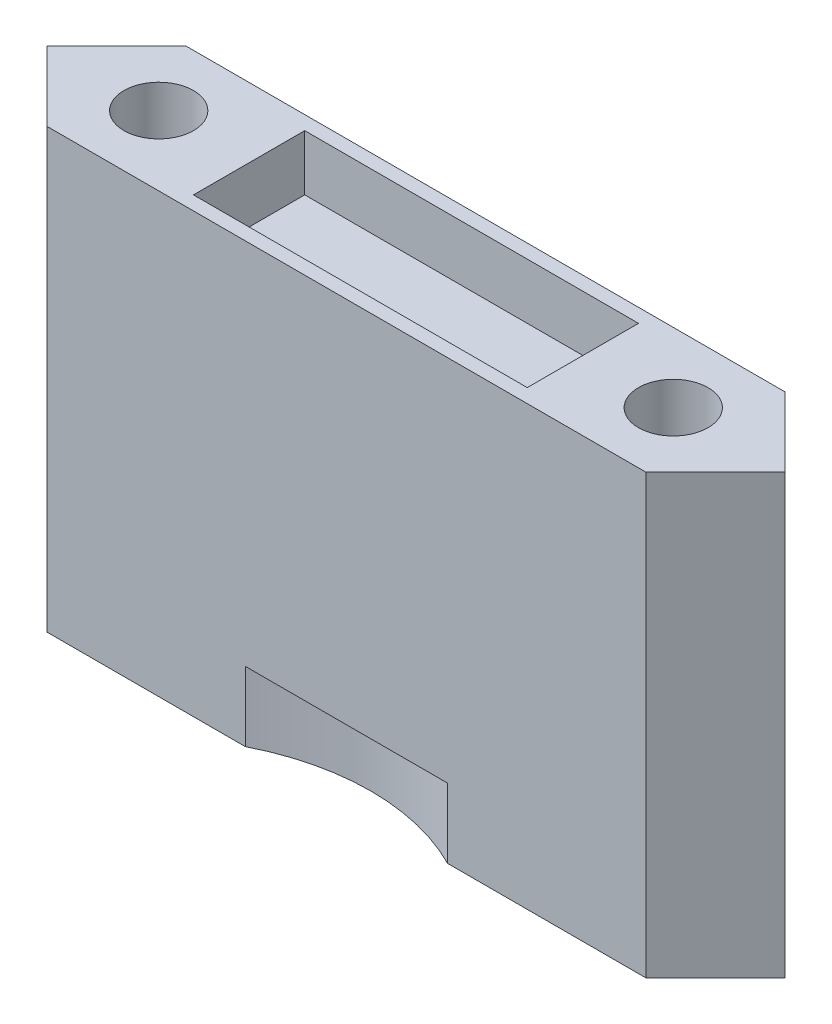
ISO-10303-21;
HEADER;
FILE_DESCRIPTION(('STEP AP214'),'2;1');
FILE_NAME('part.step','',(''),(''),'','','');
FILE_SCHEMA(('AUTOMOTIVE_DESIGN { 1 0 10303 214 1 1 1 1 }'));
ENDSEC;
DATA;
#1=APPLICATION_CONTEXT('core data for automotive mechanical design processes');
#2=APPLICATION_PROTOCOL_DEFINITION('international standard','automotive_design',2000,#1);
#3=PRODUCT_CONTEXT('',#1,'mechanical');
#4=PRODUCT('Part','Part','',(#3));
#5=PRODUCT_RELATED_PRODUCT_CATEGORY('part','',(#4));
#6=PRODUCT_DEFINITION_FORMATION('','',#4);
#7=PRODUCT_DEFINITION_CONTEXT('part definition',#1,'design');
#8=PRODUCT_DEFINITION('design','',#6,#7);
#9=PRODUCT_DEFINITION_SHAPE('','',#8);
#10=(LENGTH_UNIT() NAMED_UNIT(*) SI_UNIT(.MILLI.,.METRE.));
#11=(NAMED_UNIT(*) PLANE_ANGLE_UNIT() SI_UNIT($,.RADIAN.));
#12=(NAMED_UNIT(*) SI_UNIT($,.STERADIAN.) SOLID_ANGLE_UNIT());
#13=UNCERTAINTY_MEASURE_WITH_UNIT(LENGTH_MEASURE(1.E-05),#10,'distance_accuracy_value','');
#14=(GEOMETRIC_REPRESENTATION_CONTEXT(3) GLOBAL_UNCERTAINTY_ASSIGNED_CONTEXT((#13)) GLOBAL_UNIT_ASSIGNED_CONTEXT((#10,
#11,#12)) REPRESENTATION_CONTEXT('',''));
#15=CARTESIAN_POINT('',(0.,0.,0.));
#16=DIRECTION('',(0.,0.,1.));
#17=DIRECTION('',(1.,0.,0.));
#18=AXIS2_PLACEMENT_3D('',#15,#16,#17);
#19=CARTESIAN_POINT('',(0.,40.,0.));
#20=DIRECTION('',(0.,1.,0.));
#21=DIRECTION('',(0.,0.,1.));
#22=AXIS2_PLACEMENT_3D('',#19,#20,#21);
#23=PLANE('',#22);
#24=DIRECTION('',(0.,0.,1.));
#25=VECTOR('',#24,1.);
#26=CARTESIAN_POINT('',(-15.24,40.,5.08));
#27=LINE('',#26,#25);
#28=CARTESIAN_POINT('',(-15.24,40.,-5.08));
#29=VERTEX_POINT('',#28);
#30=CARTESIAN_POINT('',(-15.24,40.,5.08));
#31=VERTEX_POINT('',#30);
#32=EDGE_CURVE('E55',#29,#31,#27,.T.);
#33=ORIENTED_EDGE('',*,*,#32,.F.);
#34=DIRECTION('',(-1.,0.,0.));
#35=VECTOR('',#34,1.);
#36=CARTESIAN_POINT('',(15.24,40.,-5.08));
#37=LINE('',#36,#35);
#38=CARTESIAN_POINT('',(15.24,40.,-5.08));
#39=VERTEX_POINT('',#38);
#40=EDGE_CURVE('E217',#39,#29,#37,.T.);
#41=ORIENTED_EDGE('',*,*,#40,.F.);
#42=DIRECTION('',(0.,0.,-1.));
#43=VECTOR('',#42,1.);
#44=CARTESIAN_POINT('',(15.24,40.,5.08));
#45=LINE('',#44,#43);
#46=CARTESIAN_POINT('',(15.24,40.,5.08));
#47=VERTEX_POINT('',#46);
#48=EDGE_CURVE('E221',#47,#39,#45,.T.);
#49=ORIENTED_EDGE('',*,*,#48,.F.);
#50=DIRECTION('',(1.,0.,0.));
#51=VECTOR('',#50,1.);
#52=CARTESIAN_POINT('',(15.24,40.,5.08));
#53=LINE('',#52,#51);
#54=EDGE_CURVE('E224',#31,#47,#53,.T.);
#55=ORIENTED_EDGE('',*,*,#54,.F.);
#56=EDGE_LOOP('',(#33,#41,#49,#55));
#57=FACE_BOUND('',#56,.T.);
#58=CARTESIAN_POINT('',(-23.495,40.,0.));
#59=DIRECTION('',(0.,1.,0.));
#60=DIRECTION('',(0.,0.,1.));
#61=AXIS2_PLACEMENT_3D('',#58,#59,#60);
#62=CIRCLE('',#61,3.175);
#63=CARTESIAN_POINT('',(-23.495,40.,3.175));
#64=VERTEX_POINT('',#63);
#65=EDGE_CURVE('E186',#64,#64,#62,.T.);
#66=ORIENTED_EDGE('',*,*,#65,.F.);
#67=EDGE_LOOP('',(#66));
#68=FACE_BOUND('',#67,.T.);
#69=DIRECTION('',(-1.,0.,0.));
#70=VECTOR('',#69,1.);
#71=CARTESIAN_POINT('',(27.3588491430402,40.,-6.35));
#72=LINE('',#71,#70);
#73=CARTESIAN_POINT('',(27.3588491430402,40.,-6.35));
#74=VERTEX_POINT('',#73);
#75=CARTESIAN_POINT('',(-27.3588491430402,40.,-6.35));
#76=VERTEX_POINT('',#75);
#77=EDGE_CURVE('E151',#74,#76,#72,.T.);
#78=ORIENTED_EDGE('',*,*,#77,.T.);
#79=DIRECTION('',(-0.707106781186551,0.,0.707106781186544));
#80=VECTOR('',#79,1.);
#81=CARTESIAN_POINT('',(-27.3588491430402,40.,-6.35));
#82=LINE('',#81,#80);
#83=CARTESIAN_POINT('',(-33.7088491430403,40.,0.));
#84=VERTEX_POINT('',#83);
#85=EDGE_CURVE('E181',#76,#84,#82,.T.);
#86=ORIENTED_EDGE('',*,*,#85,.T.);
#87=DIRECTION('',(0.707106781186551,0.,0.707106781186544));
#88=VECTOR('',#87,1.);
#89=CARTESIAN_POINT('',(-33.7088491430403,40.,0.));
#90=LINE('',#89,#88);
#91=CARTESIAN_POINT('',(-27.3588491430402,40.,6.35));
#92=VERTEX_POINT('',#91);
#93=EDGE_CURVE('E178',#84,#92,#90,.T.);
#94=ORIENTED_EDGE('',*,*,#93,.T.);
#95=DIRECTION('',(1.,0.,0.));
#96=VECTOR('',#95,1.);
#97=CARTESIAN_POINT('',(27.3588491430402,40.,6.35));
#98=LINE('',#97,#96);
#99=CARTESIAN_POINT('',(27.3588491430402,40.,6.35));
#100=VERTEX_POINT('',#99);
#101=EDGE_CURVE('E192',#92,#100,#98,.T.);
#102=ORIENTED_EDGE('',*,*,#101,.T.);
#103=DIRECTION('',(0.707106781186551,0.,-0.707106781186544));
#104=VECTOR('',#103,1.);
#105=CARTESIAN_POINT('',(33.7088491430403,40.,0.));
#106=LINE('',#105,#104);
#107=CARTESIAN_POINT('',(33.7088491430403,40.,0.));
#108=VERTEX_POINT('',#107);
#109=EDGE_CURVE('E190',#100,#108,#106,.T.);
#110=ORIENTED_EDGE('',*,*,#109,.T.);
#111=DIRECTION('',(-0.707106781186551,0.,-0.707106781186544));
#112=VECTOR('',#111,1.);
#113=CARTESIAN_POINT('',(27.3588491430402,40.,-6.35));
#114=LINE('',#113,#112);
#115=EDGE_CURVE('E156',#108,#74,#114,.T.);
#116=ORIENTED_EDGE('',*,*,#115,.T.);
#117=EDGE_LOOP('',(#78,#86,#94,#102,#110,#116));
#118=FACE_BOUND('',#117,.T.);
#119=CARTESIAN_POINT('',(23.495,40.,0.));
#120=DIRECTION('',(0.,1.,0.));
#121=DIRECTION('',(0.,0.,1.));
#122=AXIS2_PLACEMENT_3D('',#119,#120,#121);
#123=CIRCLE('',#122,3.175);
#124=CARTESIAN_POINT('',(23.495,40.,3.175));
#125=VERTEX_POINT('',#124);
#126=EDGE_CURVE('E200',#125,#125,#123,.T.);
#127=ORIENTED_EDGE('',*,*,#126,.F.);
#128=EDGE_LOOP('',(#127));
#129=FACE_BOUND('',#128,.T.);
#130=ADVANCED_FACE('F33',(#57,#68,#118,#129),#23,.T.);
#131=CARTESIAN_POINT('',(0.,0.,0.));
#132=DIRECTION('',(0.,1.,0.));
#133=DIRECTION('',(0.,0.,1.));
#134=AXIS2_PLACEMENT_3D('',#131,#132,#133);
#135=PLANE('',#134);
#136=DIRECTION('',(1.,0.,0.));
#137=VECTOR('',#136,1.);
#138=CARTESIAN_POINT('',(27.3588491430402,0.,6.35));
#139=LINE('',#138,#137);
#140=CARTESIAN_POINT('',(9.23527800177862,0.,6.35));
#141=VERTEX_POINT('',#140);
#142=CARTESIAN_POINT('',(27.3588491430402,0.,6.35));
#143=VERTEX_POINT('',#142);
#144=EDGE_CURVE('E133',#141,#143,#139,.T.);
#145=ORIENTED_EDGE('',*,*,#144,.F.);
#146=CARTESIAN_POINT('',(0.,0.,24.4500563598532));
#147=DIRECTION('',(0.,-1.,0.));
#148=DIRECTION('',(0.,0.,-1.));
#149=AXIS2_PLACEMENT_3D('',#146,#147,#148);
#150=CIRCLE('',#149,20.32);
#151=CARTESIAN_POINT('',(-9.23527800177862,0.,6.35));
#152=VERTEX_POINT('',#151);
#153=EDGE_CURVE('E121',#152,#141,#150,.T.);
#154=ORIENTED_EDGE('',*,*,#153,.F.);
#155=CARTESIAN_POINT('',(-27.3588491430402,0.,6.35));
#156=VERTEX_POINT('',#155);
#157=EDGE_CURVE('E141',#156,#152,#139,.T.);
#158=ORIENTED_EDGE('',*,*,#157,.F.);
#159=DIRECTION('',(0.707106781186551,0.,0.707106781186544));
#160=VECTOR('',#159,1.);
#161=CARTESIAN_POINT('',(-33.7088491430403,0.,0.));
#162=LINE('',#161,#160);
#163=CARTESIAN_POINT('',(-33.7088491430403,0.,0.));
#164=VERTEX_POINT('',#163);
#165=EDGE_CURVE('E142',#164,#156,#162,.T.);
#166=ORIENTED_EDGE('',*,*,#165,.F.);
#167=DIRECTION('',(-0.707106781186551,0.,0.707106781186544));
#168=VECTOR('',#167,1.);
#169=CARTESIAN_POINT('',(-27.3588491430402,0.,-6.35));
#170=LINE('',#169,#168);
#171=CARTESIAN_POINT('',(-27.3588491430402,0.,-6.35));
#172=VERTEX_POINT('',#171);
#173=EDGE_CURVE('E144',#172,#164,#170,.T.);
#174=ORIENTED_EDGE('',*,*,#173,.F.);
#175=DIRECTION('',(-1.,0.,0.));
#176=VECTOR('',#175,1.);
#177=CARTESIAN_POINT('',(27.3588491430402,0.,-6.35));
#178=LINE('',#177,#176);
#179=CARTESIAN_POINT('',(27.3588491430402,0.,-6.35));
#180=VERTEX_POINT('',#179);
#181=EDGE_CURVE('E185',#180,#172,#178,.T.);
#182=ORIENTED_EDGE('',*,*,#181,.F.);
#183=DIRECTION('',(-0.707106781186551,0.,-0.707106781186544));
#184=VECTOR('',#183,1.);
#185=CARTESIAN_POINT('',(27.3588491430402,0.,-6.35));
#186=LINE('',#185,#184);
#187=CARTESIAN_POINT('',(33.7088491430403,0.,0.));
#188=VERTEX_POINT('',#187);
#189=EDGE_CURVE('E149',#188,#180,#186,.T.);
#190=ORIENTED_EDGE('',*,*,#189,.F.);
#191=DIRECTION('',(0.707106781186551,0.,-0.707106781186544));
#192=VECTOR('',#191,1.);
#193=CARTESIAN_POINT('',(33.7088491430403,0.,0.));
#194=LINE('',#193,#192);
#195=EDGE_CURVE('E140',#143,#188,#194,.T.);
#196=ORIENTED_EDGE('',*,*,#195,.F.);
#197=EDGE_LOOP('',(#145,#154,#158,#166,#174,#182,#190,#196));
#198=FACE_BOUND('',#197,.T.);
#199=CARTESIAN_POINT('',(-23.495,0.,0.));
#200=DIRECTION('',(0.,1.,0.));
#201=DIRECTION('',(0.,0.,1.));
#202=AXIS2_PLACEMENT_3D('',#199,#200,#201);
#203=CIRCLE('',#202,3.175);
#204=CARTESIAN_POINT('',(-23.495,0.,3.175));
#205=VERTEX_POINT('',#204);
#206=EDGE_CURVE('E197',#205,#205,#203,.T.);
#207=ORIENTED_EDGE('',*,*,#206,.T.);
#208=EDGE_LOOP('',(#207));
#209=FACE_BOUND('',#208,.T.);
#210=CARTESIAN_POINT('',(23.495,0.,0.));
#211=DIRECTION('',(0.,1.,0.));
#212=DIRECTION('',(0.,0.,1.));
#213=AXIS2_PLACEMENT_3D('',#210,#211,#212);
#214=CIRCLE('',#213,3.175);
#215=CARTESIAN_POINT('',(23.495,0.,3.175));
#216=VERTEX_POINT('',#215);
#217=EDGE_CURVE('E203',#216,#216,#214,.T.);
#218=ORIENTED_EDGE('',*,*,#217,.T.);
#219=EDGE_LOOP('',(#218));
#220=FACE_BOUND('',#219,.T.);
#221=ADVANCED_FACE('F137',(#198,#209,#220),#135,.F.);
#222=CARTESIAN_POINT('',(27.3588491430402,40.,-6.35));
#223=DIRECTION('',(0.,0.,1.));
#224=DIRECTION('',(1.,0.,0.));
#225=AXIS2_PLACEMENT_3D('',#222,#223,#224);
#226=PLANE('',#225);
#227=ORIENTED_EDGE('',*,*,#181,.T.);
#228=DIRECTION('',(0.,-1.,0.));
#229=VECTOR('',#228,1.);
#230=CARTESIAN_POINT('',(-27.3588491430402,40.,-6.35));
#231=LINE('',#230,#229);
#232=EDGE_CURVE('E167',#76,#172,#231,.T.);
#233=ORIENTED_EDGE('',*,*,#232,.F.);
#234=ORIENTED_EDGE('',*,*,#77,.F.);
#235=DIRECTION('',(0.,-1.,0.));
#236=VECTOR('',#235,1.);
#237=CARTESIAN_POINT('',(27.3588491430402,40.,-6.35));
#238=LINE('',#237,#236);
#239=EDGE_CURVE('E152',#74,#180,#238,.T.);
#240=ORIENTED_EDGE('',*,*,#239,.T.);
#241=EDGE_LOOP('',(#227,#233,#234,#240));
#242=FACE_BOUND('',#241,.T.);
#243=ADVANCED_FACE('F35',(#242),#226,.F.);
#244=CARTESIAN_POINT('',(-27.3588491430402,40.,-6.35));
#245=DIRECTION('',(0.707106781186544,0.,0.707106781186551));
#246=DIRECTION('',(0.707106781186551,0.,-0.707106781186544));
#247=AXIS2_PLACEMENT_3D('',#244,#245,#246);
#248=PLANE('',#247);
#249=ORIENTED_EDGE('',*,*,#173,.T.);
#250=DIRECTION('',(0.,-1.,0.));
#251=VECTOR('',#250,1.);
#252=CARTESIAN_POINT('',(-33.7088491430403,40.,0.));
#253=LINE('',#252,#251);
#254=EDGE_CURVE('E164',#84,#164,#253,.T.);
#255=ORIENTED_EDGE('',*,*,#254,.F.);
#256=ORIENTED_EDGE('',*,*,#85,.F.);
#257=ORIENTED_EDGE('',*,*,#232,.T.);
#258=EDGE_LOOP('',(#249,#255,#256,#257));
#259=FACE_BOUND('',#258,.T.);
#260=ADVANCED_FACE('F180',(#259),#248,.F.);
#261=CARTESIAN_POINT('',(-33.7088491430403,40.,0.));
#262=DIRECTION('',(0.707106781186544,0.,-0.707106781186551));
#263=DIRECTION('',(-0.707106781186551,0.,-0.707106781186544));
#264=AXIS2_PLACEMENT_3D('',#261,#262,#263);
#265=PLANE('',#264);
#266=ORIENTED_EDGE('',*,*,#165,.T.);
#267=DIRECTION('',(0.,-1.,0.));
#268=VECTOR('',#267,1.);
#269=CARTESIAN_POINT('',(-27.3588491430402,40.,6.35));
#270=LINE('',#269,#268);
#271=EDGE_CURVE('E161',#92,#156,#270,.T.);
#272=ORIENTED_EDGE('',*,*,#271,.F.);
#273=ORIENTED_EDGE('',*,*,#93,.F.);
#274=ORIENTED_EDGE('',*,*,#254,.T.);
#275=EDGE_LOOP('',(#266,#272,#273,#274));
#276=FACE_BOUND('',#275,.T.);
#277=ADVANCED_FACE('F175',(#276),#265,.F.);
#278=CARTESIAN_POINT('',(27.3588491430402,40.,6.35));
#279=DIRECTION('',(0.,0.,-1.));
#280=DIRECTION('',(-1.,0.,0.));
#281=AXIS2_PLACEMENT_3D('',#278,#279,#280);
#282=PLANE('',#281);
#283=DIRECTION('',(-1.,0.,0.));
#284=VECTOR('',#283,1.);
#285=CARTESIAN_POINT('',(27.3588491430402,6.35,6.35));
#286=LINE('',#285,#284);
#287=CARTESIAN_POINT('',(9.23527800177862,6.35,6.35));
#288=VERTEX_POINT('',#287);
#289=CARTESIAN_POINT('',(-9.23527800177862,6.35,6.35));
#290=VERTEX_POINT('',#289);
#291=EDGE_CURVE('E135',#288,#290,#286,.T.);
#292=ORIENTED_EDGE('',*,*,#291,.F.);
#293=DIRECTION('',(0.,-1.,0.));
#294=VECTOR('',#293,1.);
#295=CARTESIAN_POINT('',(9.23527800177862,6.35,6.35));
#296=LINE('',#295,#294);
#297=EDGE_CURVE('E11',#288,#141,#296,.T.);
#298=ORIENTED_EDGE('',*,*,#297,.T.);
#299=ORIENTED_EDGE('',*,*,#144,.T.);
#300=DIRECTION('',(0.,-1.,0.));
#301=VECTOR('',#300,1.);
#302=CARTESIAN_POINT('',(27.3588491430402,40.,6.35));
#303=LINE('',#302,#301);
#304=EDGE_CURVE('E159',#100,#143,#303,.T.);
#305=ORIENTED_EDGE('',*,*,#304,.F.);
#306=ORIENTED_EDGE('',*,*,#101,.F.);
#307=ORIENTED_EDGE('',*,*,#271,.T.);
#308=ORIENTED_EDGE('',*,*,#157,.T.);
#309=DIRECTION('',(0.,-1.,0.));
#310=VECTOR('',#309,1.);
#311=CARTESIAN_POINT('',(-9.23527800177862,6.35,6.35));
#312=LINE('',#311,#310);
#313=EDGE_CURVE('E41',#152,#290,#312,.F.);
#314=ORIENTED_EDGE('',*,*,#313,.T.);
#315=EDGE_LOOP('',(#292,#298,#299,#305,#306,#307,#308,#314));
#316=FACE_BOUND('',#315,.T.);
#317=ADVANCED_FACE('F131',(#316),#282,.F.);
#318=CARTESIAN_POINT('',(33.7088491430403,40.,0.));
#319=DIRECTION('',(-0.707106781186544,0.,-0.707106781186551));
#320=DIRECTION('',(-0.707106781186551,0.,0.707106781186544));
#321=AXIS2_PLACEMENT_3D('',#318,#319,#320);
#322=PLANE('',#321);
#323=ORIENTED_EDGE('',*,*,#195,.T.);
#324=DIRECTION('',(0.,-1.,0.));
#325=VECTOR('',#324,1.);
#326=CARTESIAN_POINT('',(33.7088491430403,40.,0.));
#327=LINE('',#326,#325);
#328=EDGE_CURVE('E155',#108,#188,#327,.T.);
#329=ORIENTED_EDGE('',*,*,#328,.F.);
#330=ORIENTED_EDGE('',*,*,#109,.F.);
#331=ORIENTED_EDGE('',*,*,#304,.T.);
#332=EDGE_LOOP('',(#323,#329,#330,#331));
#333=FACE_BOUND('',#332,.T.);
#334=ADVANCED_FACE('F282',(#333),#322,.F.);
#335=CARTESIAN_POINT('',(27.3588491430402,40.,-6.35));
#336=DIRECTION('',(-0.707106781186544,0.,0.707106781186551));
#337=DIRECTION('',(0.707106781186551,0.,0.707106781186544));
#338=AXIS2_PLACEMENT_3D('',#335,#336,#337);
#339=PLANE('',#338);
#340=ORIENTED_EDGE('',*,*,#189,.T.);
#341=ORIENTED_EDGE('',*,*,#239,.F.);
#342=ORIENTED_EDGE('',*,*,#115,.F.);
#343=ORIENTED_EDGE('',*,*,#328,.T.);
#344=EDGE_LOOP('',(#340,#341,#342,#343));
#345=FACE_BOUND('',#344,.T.);
#346=ADVANCED_FACE('F279',(#345),#339,.F.);
#347=CARTESIAN_POINT('',(-23.495,40.,0.));
#348=DIRECTION('',(0.,-1.,0.));
#349=DIRECTION('',(0.,0.,-1.));
#350=AXIS2_PLACEMENT_3D('',#347,#348,#349);
#351=CYLINDRICAL_SURFACE('',#350,3.175);
#352=ORIENTED_EDGE('',*,*,#65,.T.);
#353=EDGE_LOOP('',(#352));
#354=FACE_BOUND('',#353,.T.);
#355=ORIENTED_EDGE('',*,*,#206,.F.);
#356=EDGE_LOOP('',(#355));
#357=FACE_BOUND('',#356,.T.);
#358=ADVANCED_FACE('F267',(#354,#357),#351,.F.);
#359=CARTESIAN_POINT('',(23.495,40.,0.));
#360=DIRECTION('',(0.,-1.,0.));
#361=DIRECTION('',(0.,0.,-1.));
#362=AXIS2_PLACEMENT_3D('',#359,#360,#361);
#363=CYLINDRICAL_SURFACE('',#362,3.175);
#364=ORIENTED_EDGE('',*,*,#126,.T.);
#365=EDGE_LOOP('',(#364));
#366=FACE_BOUND('',#365,.T.);
#367=ORIENTED_EDGE('',*,*,#217,.F.);
#368=EDGE_LOOP('',(#367));
#369=FACE_BOUND('',#368,.T.);
#370=ADVANCED_FACE('F264',(#366,#369),#363,.F.);
#371=CARTESIAN_POINT('',(-15.24,34.92,5.08));
#372=DIRECTION('',(-1.,0.,0.));
#373=DIRECTION('',(0.,0.,1.));
#374=AXIS2_PLACEMENT_3D('',#371,#372,#373);
#375=PLANE('',#374);
#376=ORIENTED_EDGE('',*,*,#32,.T.);
#377=DIRECTION('',(0.,1.,0.));
#378=VECTOR('',#377,1.);
#379=CARTESIAN_POINT('',(-15.24,34.92,5.08));
#380=LINE('',#379,#378);
#381=CARTESIAN_POINT('',(-15.24,34.92,5.08));
#382=VERTEX_POINT('',#381);
#383=EDGE_CURVE('E209',#382,#31,#380,.T.);
#384=ORIENTED_EDGE('',*,*,#383,.F.);
#385=DIRECTION('',(0.,0.,1.));
#386=VECTOR('',#385,1.);
#387=CARTESIAN_POINT('',(-15.24,34.92,5.08));
#388=LINE('',#387,#386);
#389=CARTESIAN_POINT('',(-15.24,34.92,-5.08));
#390=VERTEX_POINT('',#389);
#391=EDGE_CURVE('E220',#390,#382,#388,.T.);
#392=ORIENTED_EDGE('',*,*,#391,.F.);
#393=DIRECTION('',(0.,1.,0.));
#394=VECTOR('',#393,1.);
#395=CARTESIAN_POINT('',(-15.24,34.92,-5.08));
#396=LINE('',#395,#394);
#397=EDGE_CURVE('E206',#390,#29,#396,.T.);
#398=ORIENTED_EDGE('',*,*,#397,.T.);
#399=EDGE_LOOP('',(#376,#384,#392,#398));
#400=FACE_BOUND('',#399,.T.);
#401=ADVANCED_FACE('F243',(#400),#375,.F.);
#402=CARTESIAN_POINT('',(15.24,34.92,-5.08));
#403=DIRECTION('',(0.,0.,-1.));
#404=DIRECTION('',(-1.,0.,0.));
#405=AXIS2_PLACEMENT_3D('',#402,#403,#404);
#406=PLANE('',#405);
#407=ORIENTED_EDGE('',*,*,#40,.T.);
#408=ORIENTED_EDGE('',*,*,#397,.F.);
#409=DIRECTION('',(-1.,0.,0.));
#410=VECTOR('',#409,1.);
#411=CARTESIAN_POINT('',(15.24,34.92,-5.08));
#412=LINE('',#411,#410);
#413=CARTESIAN_POINT('',(15.24,34.92,-5.08));
#414=VERTEX_POINT('',#413);
#415=EDGE_CURVE('E212',#414,#390,#412,.T.);
#416=ORIENTED_EDGE('',*,*,#415,.F.);
#417=DIRECTION('',(0.,1.,0.));
#418=VECTOR('',#417,1.);
#419=CARTESIAN_POINT('',(15.24,34.92,-5.08));
#420=LINE('',#419,#418);
#421=EDGE_CURVE('E214',#414,#39,#420,.T.);
#422=ORIENTED_EDGE('',*,*,#421,.T.);
#423=EDGE_LOOP('',(#407,#408,#416,#422));
#424=FACE_BOUND('',#423,.T.);
#425=ADVANCED_FACE('F252',(#424),#406,.F.);
#426=CARTESIAN_POINT('',(15.24,34.92,5.08));
#427=DIRECTION('',(1.,0.,0.));
#428=DIRECTION('',(0.,0.,-1.));
#429=AXIS2_PLACEMENT_3D('',#426,#427,#428);
#430=PLANE('',#429);
#431=ORIENTED_EDGE('',*,*,#48,.T.);
#432=ORIENTED_EDGE('',*,*,#421,.F.);
#433=DIRECTION('',(0.,0.,-1.));
#434=VECTOR('',#433,1.);
#435=CARTESIAN_POINT('',(15.24,34.92,5.08));
#436=LINE('',#435,#434);
#437=CARTESIAN_POINT('',(15.24,34.92,5.08));
#438=VERTEX_POINT('',#437);
#439=EDGE_CURVE('E230',#438,#414,#436,.T.);
#440=ORIENTED_EDGE('',*,*,#439,.F.);
#441=DIRECTION('',(0.,1.,0.));
#442=VECTOR('',#441,1.);
#443=CARTESIAN_POINT('',(15.24,34.92,5.08));
#444=LINE('',#443,#442);
#445=EDGE_CURVE('E211',#438,#47,#444,.T.);
#446=ORIENTED_EDGE('',*,*,#445,.T.);
#447=EDGE_LOOP('',(#431,#432,#440,#446));
#448=FACE_BOUND('',#447,.T.);
#449=ADVANCED_FACE('F250',(#448),#430,.F.);
#450=CARTESIAN_POINT('',(15.24,34.92,5.08));
#451=DIRECTION('',(0.,0.,1.));
#452=DIRECTION('',(1.,0.,0.));
#453=AXIS2_PLACEMENT_3D('',#450,#451,#452);
#454=PLANE('',#453);
#455=ORIENTED_EDGE('',*,*,#54,.T.);
#456=ORIENTED_EDGE('',*,*,#445,.F.);
#457=DIRECTION('',(1.,0.,0.));
#458=VECTOR('',#457,1.);
#459=CARTESIAN_POINT('',(15.24,34.92,5.08));
#460=LINE('',#459,#458);
#461=EDGE_CURVE('E233',#382,#438,#460,.T.);
#462=ORIENTED_EDGE('',*,*,#461,.F.);
#463=ORIENTED_EDGE('',*,*,#383,.T.);
#464=EDGE_LOOP('',(#455,#456,#462,#463));
#465=FACE_BOUND('',#464,.T.);
#466=ADVANCED_FACE('F246',(#465),#454,.F.);
#467=CARTESIAN_POINT('',(0.,34.92,0.));
#468=DIRECTION('',(0.,1.,0.));
#469=DIRECTION('',(0.,0.,1.));
#470=AXIS2_PLACEMENT_3D('',#467,#468,#469);
#471=PLANE('',#470);
#472=ORIENTED_EDGE('',*,*,#391,.T.);
#473=ORIENTED_EDGE('',*,*,#461,.T.);
#474=ORIENTED_EDGE('',*,*,#439,.T.);
#475=ORIENTED_EDGE('',*,*,#415,.T.);
#476=EDGE_LOOP('',(#472,#473,#474,#475));
#477=FACE_BOUND('',#476,.T.);
#478=ADVANCED_FACE('F240',(#477),#471,.T.);
#479=CARTESIAN_POINT('',(0.,6.35,24.4500563598532));
#480=DIRECTION('',(0.,-1.,0.));
#481=DIRECTION('',(0.,0.,-1.));
#482=AXIS2_PLACEMENT_3D('',#479,#480,#481);
#483=CYLINDRICAL_SURFACE('',#482,20.32);
#484=CARTESIAN_POINT('',(0.,6.35,24.4500563598532));
#485=DIRECTION('',(0.,-1.,0.));
#486=DIRECTION('',(0.,0.,-1.));
#487=AXIS2_PLACEMENT_3D('',#484,#485,#486);
#488=CIRCLE('',#487,20.32);
#489=EDGE_CURVE('E47',#290,#288,#488,.T.);
#490=ORIENTED_EDGE('',*,*,#489,.F.);
#491=ORIENTED_EDGE('',*,*,#313,.F.);
#492=ORIENTED_EDGE('',*,*,#153,.T.);
#493=ORIENTED_EDGE('',*,*,#297,.F.);
#494=EDGE_LOOP('',(#490,#491,#492,#493));
#495=FACE_BOUND('',#494,.T.);
#496=ADVANCED_FACE('F122',(#495),#483,.F.);
#497=CARTESIAN_POINT('',(0.,6.35,24.4500563598532));
#498=DIRECTION('',(0.,-1.,0.));
#499=DIRECTION('',(0.,0.,-1.));
#500=AXIS2_PLACEMENT_3D('',#497,#498,#499);
#501=PLANE('',#500);
#502=ORIENTED_EDGE('',*,*,#291,.T.);
#503=ORIENTED_EDGE('',*,*,#489,.T.);
#504=EDGE_LOOP('',(#502,#503));
#505=FACE_BOUND('',#504,.T.);
#506=ADVANCED_FACE('F358',(#505),#501,.T.);
#507=CLOSED_SHELL('',(#130,#221,#243,#260,#277,#317,#334,#346,#358,#370,#401,#425,#449,#466,
#478,#496,#506));
#508=MANIFOLD_SOLID_BREP('B2',#507);
#509=ADVANCED_BREP_SHAPE_REPRESENTATION('',(#18,#508),#14);
#510=SHAPE_DEFINITION_REPRESENTATION(#9,#509);
ENDSEC;
END-ISO-10303-21;
